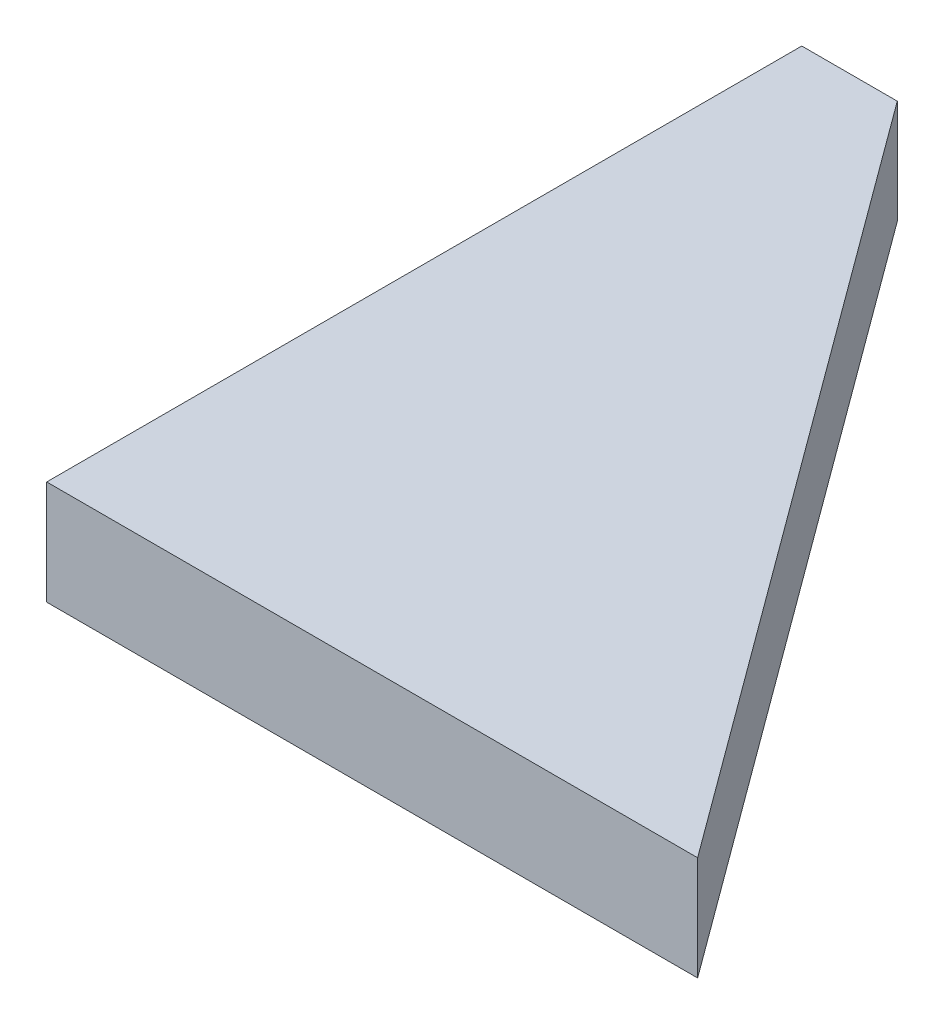
ISO-10303-21;
HEADER;
FILE_DESCRIPTION(('STEP AP214'),'2;1');
FILE_NAME('part.step','',(''),(''),'','','');
FILE_SCHEMA(('AUTOMOTIVE_DESIGN { 1 0 10303 214 1 1 1 1 }'));
ENDSEC;
DATA;
#1=APPLICATION_CONTEXT('core data for automotive mechanical design processes');
#2=APPLICATION_PROTOCOL_DEFINITION('international standard','automotive_design',2000,#1);
#3=PRODUCT_CONTEXT('',#1,'mechanical');
#4=PRODUCT('Part','Part','',(#3));
#5=PRODUCT_RELATED_PRODUCT_CATEGORY('part','',(#4));
#6=PRODUCT_DEFINITION_FORMATION('','',#4);
#7=PRODUCT_DEFINITION_CONTEXT('part definition',#1,'design');
#8=PRODUCT_DEFINITION('design','',#6,#7);
#9=PRODUCT_DEFINITION_SHAPE('','',#8);
#10=(LENGTH_UNIT() NAMED_UNIT(*) SI_UNIT(.MILLI.,.METRE.));
#11=(NAMED_UNIT(*) PLANE_ANGLE_UNIT() SI_UNIT($,.RADIAN.));
#12=(NAMED_UNIT(*) SI_UNIT($,.STERADIAN.) SOLID_ANGLE_UNIT());
#13=UNCERTAINTY_MEASURE_WITH_UNIT(LENGTH_MEASURE(1.E-05),#10,'distance_accuracy_value','');
#14=(GEOMETRIC_REPRESENTATION_CONTEXT(3) GLOBAL_UNCERTAINTY_ASSIGNED_CONTEXT((#13)) GLOBAL_UNIT_ASSIGNED_CONTEXT((#10,
#11,#12)) REPRESENTATION_CONTEXT('',''));
#15=CARTESIAN_POINT('',(0.,0.,0.));
#16=DIRECTION('',(0.,0.,1.));
#17=DIRECTION('',(1.,0.,0.));
#18=AXIS2_PLACEMENT_3D('',#15,#16,#17);
#19=CARTESIAN_POINT('',(25.,4.,-1.47503813678718));
#20=DIRECTION('',(0.,0.,-1.));
#21=DIRECTION('',(-1.,0.,0.));
#22=AXIS2_PLACEMENT_3D('',#19,#20,#21);
#23=PLANE('',#22);
#24=DIRECTION('',(1.,0.,0.));
#25=VECTOR('',#24,1.);
#26=CARTESIAN_POINT('',(25.,0.,-1.47503813678718));
#27=LINE('',#26,#25);
#28=CARTESIAN_POINT('',(0.,0.,-1.47503813678718));
#29=VERTEX_POINT('',#28);
#30=CARTESIAN_POINT('',(25.,0.,-1.47503813678718));
#31=VERTEX_POINT('',#30);
#32=EDGE_CURVE('E97',#29,#31,#27,.T.);
#33=ORIENTED_EDGE('',*,*,#32,.T.);
#34=DIRECTION('',(0.,-1.,0.));
#35=VECTOR('',#34,1.);
#36=CARTESIAN_POINT('',(25.,4.,-1.47503813678718));
#37=LINE('',#36,#35);
#38=CARTESIAN_POINT('',(25.,4.,-1.47503813678718));
#39=VERTEX_POINT('',#38);
#40=EDGE_CURVE('E11',#39,#31,#37,.T.);
#41=ORIENTED_EDGE('',*,*,#40,.F.);
#42=DIRECTION('',(1.,0.,0.));
#43=VECTOR('',#42,1.);
#44=CARTESIAN_POINT('',(25.,4.,-1.47503813678718));
#45=LINE('',#44,#43);
#46=CARTESIAN_POINT('',(0.,4.,-1.47503813678718));
#47=VERTEX_POINT('',#46);
#48=EDGE_CURVE('E85',#47,#39,#45,.T.);
#49=ORIENTED_EDGE('',*,*,#48,.F.);
#50=DIRECTION('',(0.,-1.,0.));
#51=VECTOR('',#50,1.);
#52=CARTESIAN_POINT('',(0.,4.,-1.47503813678718));
#53=LINE('',#52,#51);
#54=EDGE_CURVE('E93',#47,#29,#53,.T.);
#55=ORIENTED_EDGE('',*,*,#54,.T.);
#56=EDGE_LOOP('',(#33,#41,#49,#55));
#57=FACE_BOUND('',#56,.T.);
#58=ADVANCED_FACE('F34',(#57),#23,.F.);
#59=CARTESIAN_POINT('',(3.66867925261611,4.,-30.4750381367872));
#60=DIRECTION('',(-0.805547709948237,0.,0.592530916490566));
#61=DIRECTION('',(0.592530916490566,0.,0.805547709948237));
#62=AXIS2_PLACEMENT_3D('',#59,#60,#61);
#63=PLANE('',#62);
#64=DIRECTION('',(-0.592530916490566,0.,-0.805547709948237));
#65=VECTOR('',#64,1.);
#66=CARTESIAN_POINT('',(3.66867925261611,0.,-30.4750381367872));
#67=LINE('',#66,#65);
#68=CARTESIAN_POINT('',(3.66867925261611,0.,-30.4750381367872));
#69=VERTEX_POINT('',#68);
#70=EDGE_CURVE('E89',#31,#69,#67,.T.);
#71=ORIENTED_EDGE('',*,*,#70,.T.);
#72=DIRECTION('',(0.,-1.,0.));
#73=VECTOR('',#72,1.);
#74=CARTESIAN_POINT('',(3.66867925261611,4.,-30.4750381367872));
#75=LINE('',#74,#73);
#76=CARTESIAN_POINT('',(3.66867925261611,4.,-30.4750381367872));
#77=VERTEX_POINT('',#76);
#78=EDGE_CURVE('E42',#77,#69,#75,.T.);
#79=ORIENTED_EDGE('',*,*,#78,.F.);
#80=DIRECTION('',(-0.592530916490566,0.,-0.805547709948237));
#81=VECTOR('',#80,1.);
#82=CARTESIAN_POINT('',(3.66867925261611,4.,-30.4750381367872));
#83=LINE('',#82,#81);
#84=EDGE_CURVE('E80',#39,#77,#83,.T.);
#85=ORIENTED_EDGE('',*,*,#84,.F.);
#86=ORIENTED_EDGE('',*,*,#40,.T.);
#87=EDGE_LOOP('',(#71,#79,#85,#86));
#88=FACE_BOUND('',#87,.T.);
#89=ADVANCED_FACE('F88',(#88),#63,.F.);
#90=CARTESIAN_POINT('',(0.,4.,-30.4750381367872));
#91=DIRECTION('',(0.,0.,1.));
#92=DIRECTION('',(1.,0.,0.));
#93=AXIS2_PLACEMENT_3D('',#90,#91,#92);
#94=PLANE('',#93);
#95=DIRECTION('',(-1.,0.,0.));
#96=VECTOR('',#95,1.);
#97=CARTESIAN_POINT('',(0.,0.,-30.4750381367872));
#98=LINE('',#97,#96);
#99=CARTESIAN_POINT('',(0.,0.,-30.4750381367872));
#100=VERTEX_POINT('',#99);
#101=EDGE_CURVE('E67',#69,#100,#98,.T.);
#102=ORIENTED_EDGE('',*,*,#101,.T.);
#103=DIRECTION('',(0.,-1.,0.));
#104=VECTOR('',#103,1.);
#105=CARTESIAN_POINT('',(0.,4.,-30.4750381367872));
#106=LINE('',#105,#104);
#107=CARTESIAN_POINT('',(0.,4.,-30.4750381367872));
#108=VERTEX_POINT('',#107);
#109=EDGE_CURVE('E90',#108,#100,#106,.T.);
#110=ORIENTED_EDGE('',*,*,#109,.F.);
#111=DIRECTION('',(-1.,0.,0.));
#112=VECTOR('',#111,1.);
#113=CARTESIAN_POINT('',(0.,4.,-30.4750381367872));
#114=LINE('',#113,#112);
#115=EDGE_CURVE('E83',#77,#108,#114,.T.);
#116=ORIENTED_EDGE('',*,*,#115,.F.);
#117=ORIENTED_EDGE('',*,*,#78,.T.);
#118=EDGE_LOOP('',(#102,#110,#116,#117));
#119=FACE_BOUND('',#118,.T.);
#120=ADVANCED_FACE('F91',(#119),#94,.F.);
#121=CARTESIAN_POINT('',(0.,4.,-1.47503813678718));
#122=DIRECTION('',(1.,0.,0.));
#123=DIRECTION('',(0.,0.,-1.));
#124=AXIS2_PLACEMENT_3D('',#121,#122,#123);
#125=PLANE('',#124);
#126=DIRECTION('',(0.,0.,1.));
#127=VECTOR('',#126,1.);
#128=CARTESIAN_POINT('',(0.,0.,-1.47503813678718));
#129=LINE('',#128,#127);
#130=EDGE_CURVE('E73',#100,#29,#129,.T.);
#131=ORIENTED_EDGE('',*,*,#130,.T.);
#132=ORIENTED_EDGE('',*,*,#54,.F.);
#133=DIRECTION('',(0.,0.,1.));
#134=VECTOR('',#133,1.);
#135=CARTESIAN_POINT('',(0.,4.,-1.47503813678718));
#136=LINE('',#135,#134);
#137=EDGE_CURVE('E50',#108,#47,#136,.T.);
#138=ORIENTED_EDGE('',*,*,#137,.F.);
#139=ORIENTED_EDGE('',*,*,#109,.T.);
#140=EDGE_LOOP('',(#131,#132,#138,#139));
#141=FACE_BOUND('',#140,.T.);
#142=ADVANCED_FACE('F104',(#141),#125,.F.);
#143=CARTESIAN_POINT('',(0.,4.,0.));
#144=DIRECTION('',(0.,-1.,0.));
#145=DIRECTION('',(0.,0.,-1.));
#146=AXIS2_PLACEMENT_3D('',#143,#144,#145);
#147=PLANE('',#146);
#148=ORIENTED_EDGE('',*,*,#48,.T.);
#149=ORIENTED_EDGE('',*,*,#84,.T.);
#150=ORIENTED_EDGE('',*,*,#115,.T.);
#151=ORIENTED_EDGE('',*,*,#137,.T.);
#152=EDGE_LOOP('',(#148,#149,#150,#151));
#153=FACE_BOUND('',#152,.T.);
#154=ADVANCED_FACE('F81',(#153),#147,.F.);
#155=CARTESIAN_POINT('',(0.,0.,0.));
#156=DIRECTION('',(0.,-1.,0.));
#157=DIRECTION('',(0.,0.,-1.));
#158=AXIS2_PLACEMENT_3D('',#155,#156,#157);
#159=PLANE('',#158);
#160=ORIENTED_EDGE('',*,*,#32,.F.);
#161=ORIENTED_EDGE('',*,*,#130,.F.);
#162=ORIENTED_EDGE('',*,*,#101,.F.);
#163=ORIENTED_EDGE('',*,*,#70,.F.);
#164=EDGE_LOOP('',(#160,#161,#162,#163));
#165=FACE_BOUND('',#164,.T.);
#166=ADVANCED_FACE('F107',(#165),#159,.T.);
#167=CLOSED_SHELL('',(#58,#89,#120,#142,#154,#166));
#168=MANIFOLD_SOLID_BREP('B2',#167);
#169=ADVANCED_BREP_SHAPE_REPRESENTATION('',(#18,#168),#14);
#170=SHAPE_DEFINITION_REPRESENTATION(#9,#169);
ENDSEC;
END-ISO-10303-21;
